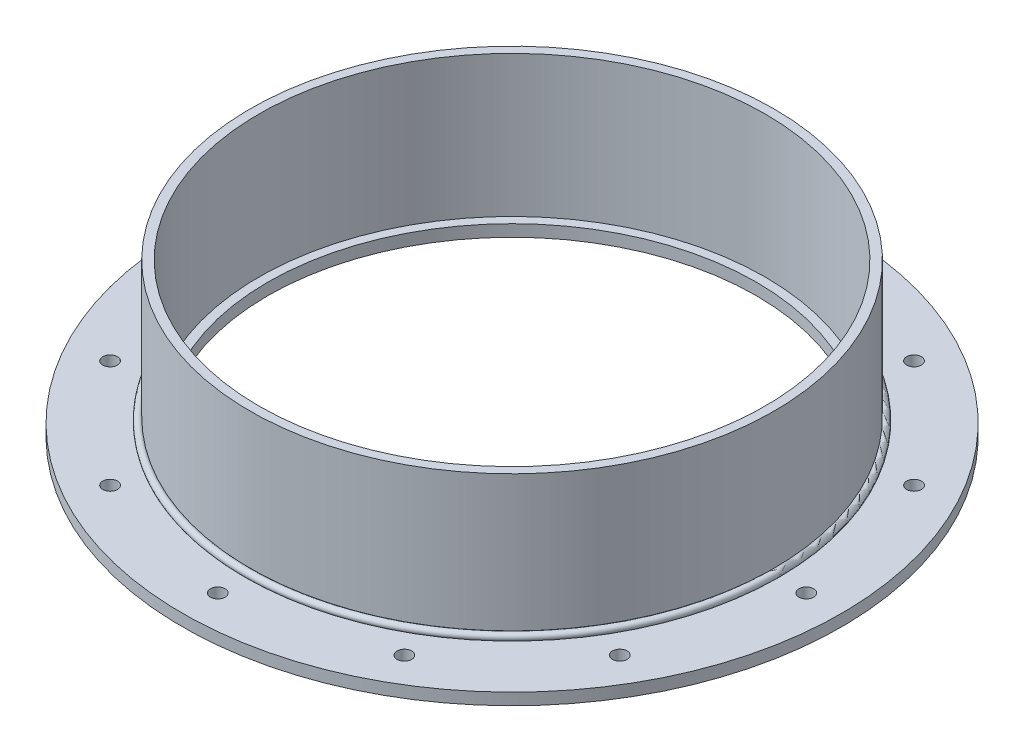
ISO-10303-21;
HEADER;
FILE_DESCRIPTION(('STEP AP214'),'2;1');
FILE_NAME('part.step','',(''),(''),'','','');
FILE_SCHEMA(('AUTOMOTIVE_DESIGN { 1 0 10303 214 1 1 1 1 }'));
ENDSEC;
DATA;
#1=APPLICATION_CONTEXT('core data for automotive mechanical design processes');
#2=APPLICATION_PROTOCOL_DEFINITION('international standard','automotive_design',2000,#1);
#3=PRODUCT_CONTEXT('',#1,'mechanical');
#4=PRODUCT('Part','Part','',(#3));
#5=PRODUCT_RELATED_PRODUCT_CATEGORY('part','',(#4));
#6=PRODUCT_DEFINITION_FORMATION('','',#4);
#7=PRODUCT_DEFINITION_CONTEXT('part definition',#1,'design');
#8=PRODUCT_DEFINITION('design','',#6,#7);
#9=PRODUCT_DEFINITION_SHAPE('','',#8);
#10=(LENGTH_UNIT() NAMED_UNIT(*) SI_UNIT(.MILLI.,.METRE.));
#11=(NAMED_UNIT(*) PLANE_ANGLE_UNIT() SI_UNIT($,.RADIAN.));
#12=(NAMED_UNIT(*) SI_UNIT($,.STERADIAN.) SOLID_ANGLE_UNIT());
#13=UNCERTAINTY_MEASURE_WITH_UNIT(LENGTH_MEASURE(1.E-05),#10,'distance_accuracy_value','');
#14=(GEOMETRIC_REPRESENTATION_CONTEXT(3) GLOBAL_UNCERTAINTY_ASSIGNED_CONTEXT((#13)) GLOBAL_UNIT_ASSIGNED_CONTEXT((#10,
#11,#12)) REPRESENTATION_CONTEXT('',''));
#15=CARTESIAN_POINT('',(0.,0.,0.));
#16=DIRECTION('',(0.,0.,1.));
#17=DIRECTION('',(1.,0.,0.));
#18=AXIS2_PLACEMENT_3D('',#15,#16,#17);
#19=CARTESIAN_POINT('',(0.,7.57337288963891,0.));
#20=DIRECTION('',(0.,-1.,0.));
#21=DIRECTION('',(0.,0.,-1.));
#22=AXIS2_PLACEMENT_3D('',#19,#20,#21);
#23=TOROIDAL_SURFACE('',#22,142.510872889639,1.98437500000001);
#24=CARTESIAN_POINT('',(0.,6.34999999999998,0.));
#25=DIRECTION('',(0.,-1.,0.));
#26=DIRECTION('',(0.,0.,-1.));
#27=AXIS2_PLACEMENT_3D('',#24,#25,#26);
#28=CIRCLE('',#27,144.073275818951);
#29=CARTESIAN_POINT('',(0.,6.34999999999998,-144.073275818951));
#30=VERTEX_POINT('',#29);
#31=EDGE_CURVE('E11',#30,#30,#28,.T.);
#32=ORIENTED_EDGE('',*,*,#31,.F.);
#33=EDGE_LOOP('',(#32));
#34=FACE_BOUND('',#33,.T.);
#35=CARTESIAN_POINT('',(0.,9.13577581895053,0.));
#36=DIRECTION('',(0.,-1.,0.));
#37=DIRECTION('',(0.,0.,-1.));
#38=AXIS2_PLACEMENT_3D('',#35,#36,#37);
#39=CIRCLE('',#38,141.2875);
#40=CARTESIAN_POINT('',(0.,9.13577581895053,-141.2875));
#41=VERTEX_POINT('',#40);
#42=EDGE_CURVE('E61',#41,#41,#39,.T.);
#43=ORIENTED_EDGE('',*,*,#42,.T.);
#44=EDGE_LOOP('',(#43));
#45=FACE_BOUND('',#44,.T.);
#46=ADVANCED_FACE('F48',(#34,#45),#23,.T.);
#47=CARTESIAN_POINT('',(-141.2875,6.34999999999998,0.));
#48=DIRECTION('',(0.,1.,0.));
#49=DIRECTION('',(0.,0.,1.));
#50=AXIS2_PLACEMENT_3D('',#47,#48,#49);
#51=PLANE('',#50);
#52=CARTESIAN_POINT('',(0.,6.34999999999998,0.));
#53=DIRECTION('',(0.,-1.,0.));
#54=DIRECTION('',(0.,0.,-1.));
#55=AXIS2_PLACEMENT_3D('',#52,#53,#54);
#56=CIRCLE('',#55,141.2875);
#57=CARTESIAN_POINT('',(0.,6.34999999999998,-141.2875));
#58=VERTEX_POINT('',#57);
#59=EDGE_CURVE('E55',#58,#58,#56,.T.);
#60=ORIENTED_EDGE('',*,*,#59,.F.);
#61=EDGE_LOOP('',(#60));
#62=FACE_BOUND('',#61,.T.);
#63=ORIENTED_EDGE('',*,*,#31,.T.);
#64=EDGE_LOOP('',(#63));
#65=FACE_BOUND('',#64,.T.);
#66=ADVANCED_FACE('F74',(#62,#65),#51,.F.);
#67=CARTESIAN_POINT('',(0.,0.,0.));
#68=DIRECTION('',(0.,-1.,0.));
#69=DIRECTION('',(0.,0.,-1.));
#70=AXIS2_PLACEMENT_3D('',#67,#68,#69);
#71=CYLINDRICAL_SURFACE('',#70,141.2875);
#72=ORIENTED_EDGE('',*,*,#42,.F.);
#73=EDGE_LOOP('',(#72));
#74=FACE_BOUND('',#73,.T.);
#75=ORIENTED_EDGE('',*,*,#59,.T.);
#76=EDGE_LOOP('',(#75));
#77=FACE_BOUND('',#76,.T.);
#78=ADVANCED_FACE('F72',(#74,#77),#71,.F.);
#79=CLOSED_SHELL('',(#46,#66,#78));
#80=MANIFOLD_SOLID_BREP('B2',#79);
#81=CARTESIAN_POINT('',(0.,0.,0.));
#82=DIRECTION('',(0.,-1.,0.));
#83=DIRECTION('',(0.,0.,-1.));
#84=AXIS2_PLACEMENT_3D('',#81,#82,#83);
#85=CYLINDRICAL_SURFACE('',#84,141.2875);
#86=CARTESIAN_POINT('',(0.,6.34999999999998,0.));
#87=DIRECTION('',(0.,-1.,0.));
#88=DIRECTION('',(0.,0.,-1.));
#89=AXIS2_PLACEMENT_3D('',#86,#87,#88);
#90=CIRCLE('',#89,141.2875);
#91=CARTESIAN_POINT('',(0.,6.34999999999998,-141.2875));
#92=VERTEX_POINT('',#91);
#93=EDGE_CURVE('E133',#92,#92,#90,.T.);
#94=ORIENTED_EDGE('',*,*,#93,.F.);
#95=EDGE_LOOP('',(#94));
#96=FACE_BOUND('',#95,.T.);
#97=CARTESIAN_POINT('',(0.,82.55,0.));
#98=DIRECTION('',(0.,-1.,0.));
#99=DIRECTION('',(0.,0.,-1.));
#100=AXIS2_PLACEMENT_3D('',#97,#98,#99);
#101=CIRCLE('',#100,141.2875);
#102=CARTESIAN_POINT('',(0.,82.55,-141.2875));
#103=VERTEX_POINT('',#102);
#104=EDGE_CURVE('E47',#103,#103,#101,.T.);
#105=ORIENTED_EDGE('',*,*,#104,.T.);
#106=EDGE_LOOP('',(#105));
#107=FACE_BOUND('',#106,.T.);
#108=ADVANCED_FACE('F114',(#96,#107),#85,.T.);
#109=CARTESIAN_POINT('',(-141.2875,82.55,0.));
#110=DIRECTION('',(0.,-1.,0.));
#111=DIRECTION('',(0.,0.,-1.));
#112=AXIS2_PLACEMENT_3D('',#109,#110,#111);
#113=PLANE('',#112);
#114=ORIENTED_EDGE('',*,*,#104,.F.);
#115=EDGE_LOOP('',(#114));
#116=FACE_BOUND('',#115,.T.);
#117=CARTESIAN_POINT('',(0.,82.55,0.));
#118=DIRECTION('',(0.,-1.,0.));
#119=DIRECTION('',(0.,0.,-1.));
#120=AXIS2_PLACEMENT_3D('',#117,#118,#119);
#121=CIRCLE('',#120,136.525);
#122=CARTESIAN_POINT('',(0.,82.55,-136.525));
#123=VERTEX_POINT('',#122);
#124=EDGE_CURVE('E121',#123,#123,#121,.T.);
#125=ORIENTED_EDGE('',*,*,#124,.T.);
#126=EDGE_LOOP('',(#125));
#127=FACE_BOUND('',#126,.T.);
#128=ADVANCED_FACE('F144',(#116,#127),#113,.F.);
#129=CARTESIAN_POINT('',(0.,0.,0.));
#130=DIRECTION('',(0.,-1.,0.));
#131=DIRECTION('',(0.,0.,-1.));
#132=AXIS2_PLACEMENT_3D('',#129,#130,#131);
#133=CYLINDRICAL_SURFACE('',#132,136.525);
#134=ORIENTED_EDGE('',*,*,#124,.F.);
#135=EDGE_LOOP('',(#134));
#136=FACE_BOUND('',#135,.T.);
#137=CARTESIAN_POINT('',(0.,6.34999999999998,0.));
#138=DIRECTION('',(0.,-1.,0.));
#139=DIRECTION('',(0.,0.,-1.));
#140=AXIS2_PLACEMENT_3D('',#137,#138,#139);
#141=CIRCLE('',#140,136.525);
#142=CARTESIAN_POINT('',(0.,6.34999999999998,-136.525));
#143=VERTEX_POINT('',#142);
#144=EDGE_CURVE('E127',#143,#143,#141,.T.);
#145=ORIENTED_EDGE('',*,*,#144,.T.);
#146=EDGE_LOOP('',(#145));
#147=FACE_BOUND('',#146,.T.);
#148=ADVANCED_FACE('F148',(#136,#147),#133,.F.);
#149=CARTESIAN_POINT('',(-141.2875,6.34999999999998,0.));
#150=DIRECTION('',(0.,1.,0.));
#151=DIRECTION('',(0.,0.,1.));
#152=AXIS2_PLACEMENT_3D('',#149,#150,#151);
#153=PLANE('',#152);
#154=ORIENTED_EDGE('',*,*,#144,.F.);
#155=EDGE_LOOP('',(#154));
#156=FACE_BOUND('',#155,.T.);
#157=ORIENTED_EDGE('',*,*,#93,.T.);
#158=EDGE_LOOP('',(#157));
#159=FACE_BOUND('',#158,.T.);
#160=ADVANCED_FACE('F141',(#156,#159),#153,.F.);
#161=CLOSED_SHELL('',(#108,#128,#148,#160));
#162=MANIFOLD_SOLID_BREP('B6',#161);
#163=CARTESIAN_POINT('',(0.,0.,0.));
#164=DIRECTION('',(0.,-1.,0.));
#165=DIRECTION('',(0.,0.,-1.));
#166=AXIS2_PLACEMENT_3D('',#163,#164,#165);
#167=CYLINDRICAL_SURFACE('',#166,131.7625);
#168=CARTESIAN_POINT('',(0.,6.34999999999999,0.));
#169=DIRECTION('',(0.,-1.,0.));
#170=DIRECTION('',(0.,0.,-1.));
#171=AXIS2_PLACEMENT_3D('',#168,#169,#170);
#172=CIRCLE('',#171,131.7625);
#173=CARTESIAN_POINT('',(0.,6.34999999999999,-131.7625));
#174=VERTEX_POINT('',#173);
#175=EDGE_CURVE('E113',#174,#174,#172,.T.);
#176=ORIENTED_EDGE('',*,*,#175,.F.);
#177=EDGE_LOOP('',(#176));
#178=FACE_BOUND('',#177,.T.);
#179=CARTESIAN_POINT('',(0.,0.,0.));
#180=DIRECTION('',(0.,-1.,0.));
#181=DIRECTION('',(0.,0.,-1.));
#182=AXIS2_PLACEMENT_3D('',#179,#180,#181);
#183=CIRCLE('',#182,131.7625);
#184=CARTESIAN_POINT('',(0.,0.,-131.7625));
#185=VERTEX_POINT('',#184);
#186=EDGE_CURVE('E211',#185,#185,#183,.T.);
#187=ORIENTED_EDGE('',*,*,#186,.T.);
#188=EDGE_LOOP('',(#187));
#189=FACE_BOUND('',#188,.T.);
#190=ADVANCED_FACE('F192',(#178,#189),#167,.F.);
#191=CARTESIAN_POINT('',(-131.7625,6.34999999999999,0.));
#192=DIRECTION('',(0.,-1.,0.));
#193=DIRECTION('',(0.,0.,-1.));
#194=AXIS2_PLACEMENT_3D('',#191,#192,#193);
#195=PLANE('',#194);
#196=CARTESIAN_POINT('',(-79.3749999999982,6.34999999999999,-137.481532850781));
#197=DIRECTION('',(0.,1.,0.));
#198=DIRECTION('',(0.499999999999989,0.,0.866025403784445));
#199=AXIS2_PLACEMENT_3D('',#196,#197,#198);
#200=CIRCLE('',#199,3.96875);
#201=CARTESIAN_POINT('',(-77.3906249999983,6.34999999999999,-134.044494529511));
#202=VERTEX_POINT('',#201);
#203=EDGE_CURVE('E306',#202,#202,#200,.T.);
#204=ORIENTED_EDGE('',*,*,#203,.F.);
#205=EDGE_LOOP('',(#204));
#206=FACE_BOUND('',#205,.T.);
#207=CARTESIAN_POINT('',(-137.481532850779,6.34999999999999,-79.3750000000016));
#208=DIRECTION('',(0.,1.,0.));
#209=DIRECTION('',(0.866025403784433,0.,0.50000000000001));
#210=AXIS2_PLACEMENT_3D('',#207,#208,#209);
#211=CIRCLE('',#210,3.96875);
#212=CARTESIAN_POINT('',(-134.044494529509,6.34999999999999,-77.3906250000016));
#213=VERTEX_POINT('',#212);
#214=EDGE_CURVE('E298',#213,#213,#211,.T.);
#215=ORIENTED_EDGE('',*,*,#214,.F.);
#216=EDGE_LOOP('',(#215));
#217=FACE_BOUND('',#216,.T.);
#218=CARTESIAN_POINT('',(-158.75,6.34999999999999,-1.66281798762404E-12));
#219=DIRECTION('',(0.,1.,0.));
#220=DIRECTION('',(1.,0.,0.));
#221=AXIS2_PLACEMENT_3D('',#218,#219,#220);
#222=CIRCLE('',#221,3.96875);
#223=CARTESIAN_POINT('',(-154.78125,6.34999999999999,-1.62124753793344E-12));
#224=VERTEX_POINT('',#223);
#225=EDGE_CURVE('E290',#224,#224,#222,.T.);
#226=ORIENTED_EDGE('',*,*,#225,.F.);
#227=EDGE_LOOP('',(#226));
#228=FACE_BOUND('',#227,.T.);
#229=CARTESIAN_POINT('',(-137.48153285078,6.34999999999999,79.3749999999987));
#230=DIRECTION('',(0.,1.,0.));
#231=DIRECTION('',(0.866025403784443,0.,-0.499999999999992));
#232=AXIS2_PLACEMENT_3D('',#229,#230,#231);
#233=CIRCLE('',#232,3.96875);
#234=CARTESIAN_POINT('',(-134.044494529511,6.34999999999999,77.3906249999987));
#235=VERTEX_POINT('',#234);
#236=EDGE_CURVE('E282',#235,#235,#233,.T.);
#237=ORIENTED_EDGE('',*,*,#236,.F.);
#238=EDGE_LOOP('',(#237));
#239=FACE_BOUND('',#238,.T.);
#240=CARTESIAN_POINT('',(-79.3750000000011,6.34999999999999,137.481532850779));
#241=DIRECTION('',(0.,1.,0.));
#242=DIRECTION('',(0.500000000000007,0.,-0.866025403784435));
#243=AXIS2_PLACEMENT_3D('',#240,#241,#242);
#244=CIRCLE('',#243,3.96875);
#245=CARTESIAN_POINT('',(-77.3906250000011,6.34999999999999,134.04449452951));
#246=VERTEX_POINT('',#245);
#247=EDGE_CURVE('E274',#246,#246,#244,.T.);
#248=ORIENTED_EDGE('',*,*,#247,.F.);
#249=EDGE_LOOP('',(#248));
#250=FACE_BOUND('',#249,.T.);
#251=CARTESIAN_POINT('',(0.,6.34999999999999,158.75));
#252=DIRECTION('',(0.,1.,0.));
#253=DIRECTION('',(0.,0.,-1.));
#254=AXIS2_PLACEMENT_3D('',#251,#252,#253);
#255=CIRCLE('',#254,3.96875);
#256=CARTESIAN_POINT('',(0.,6.34999999999999,154.78125));
#257=VERTEX_POINT('',#256);
#258=EDGE_CURVE('E266',#257,#257,#255,.T.);
#259=ORIENTED_EDGE('',*,*,#258,.F.);
#260=EDGE_LOOP('',(#259));
#261=FACE_BOUND('',#260,.T.);
#262=CARTESIAN_POINT('',(79.3749999999992,6.34999999999999,137.48153285078));
#263=DIRECTION('',(0.,1.,0.));
#264=DIRECTION('',(-0.499999999999995,0.,-0.866025403784442));
#265=AXIS2_PLACEMENT_3D('',#262,#263,#264);
#266=CIRCLE('',#265,3.96875);
#267=CARTESIAN_POINT('',(77.3906249999992,6.34999999999999,134.044494529511));
#268=VERTEX_POINT('',#267);
#269=EDGE_CURVE('E258',#268,#268,#266,.T.);
#270=ORIENTED_EDGE('',*,*,#269,.F.);
#271=EDGE_LOOP('',(#270));
#272=FACE_BOUND('',#271,.T.);
#273=CARTESIAN_POINT('',(137.481532850779,6.34999999999999,79.3750000000007));
#274=DIRECTION('',(0.,1.,0.));
#275=DIRECTION('',(-0.866025403784436,0.,-0.500000000000004));
#276=AXIS2_PLACEMENT_3D('',#273,#274,#275);
#277=CIRCLE('',#276,3.96875);
#278=CARTESIAN_POINT('',(134.04449452951,6.34999999999999,77.3906250000006));
#279=VERTEX_POINT('',#278);
#280=EDGE_CURVE('E250',#279,#279,#277,.T.);
#281=ORIENTED_EDGE('',*,*,#280,.F.);
#282=EDGE_LOOP('',(#281));
#283=FACE_BOUND('',#282,.T.);
#284=CARTESIAN_POINT('',(158.75,6.34999999999999,5.54272662541347E-13));
#285=DIRECTION('',(0.,1.,0.));
#286=DIRECTION('',(-1.,0.,0.));
#287=AXIS2_PLACEMENT_3D('',#284,#285,#286);
#288=CIRCLE('',#287,3.96875);
#289=CARTESIAN_POINT('',(154.78125,6.34999999999999,5.40415845977814E-13));
#290=VERTEX_POINT('',#289);
#291=EDGE_CURVE('E242',#290,#290,#288,.T.);
#292=ORIENTED_EDGE('',*,*,#291,.F.);
#293=EDGE_LOOP('',(#292));
#294=FACE_BOUND('',#293,.T.);
#295=CARTESIAN_POINT('',(137.48153285078,6.34999999999999,-79.3749999999997));
#296=DIRECTION('',(0.,1.,0.));
#297=DIRECTION('',(-0.86602540378444,0.,0.499999999999998));
#298=AXIS2_PLACEMENT_3D('',#295,#296,#297);
#299=CIRCLE('',#298,3.96875);
#300=CARTESIAN_POINT('',(134.04449452951,6.34999999999999,-77.3906249999997));
#301=VERTEX_POINT('',#300);
#302=EDGE_CURVE('E234',#301,#301,#299,.T.);
#303=ORIENTED_EDGE('',*,*,#302,.F.);
#304=EDGE_LOOP('',(#303));
#305=FACE_BOUND('',#304,.T.);
#306=CARTESIAN_POINT('',(79.3750000000002,6.34999999999999,-137.48153285078));
#307=DIRECTION('',(0.,1.,0.));
#308=DIRECTION('',(-0.500000000000001,0.,0.866025403784438));
#309=AXIS2_PLACEMENT_3D('',#306,#307,#308);
#310=CIRCLE('',#309,3.96875);
#311=CARTESIAN_POINT('',(77.3906250000002,6.34999999999999,-134.04449452951));
#312=VERTEX_POINT('',#311);
#313=EDGE_CURVE('E226',#312,#312,#310,.T.);
#314=ORIENTED_EDGE('',*,*,#313,.F.);
#315=EDGE_LOOP('',(#314));
#316=FACE_BOUND('',#315,.T.);
#317=CARTESIAN_POINT('',(0.,6.34999999999999,-158.75));
#318=DIRECTION('',(0.,1.,0.));
#319=DIRECTION('',(0.,0.,1.));
#320=AXIS2_PLACEMENT_3D('',#317,#318,#319);
#321=CIRCLE('',#320,3.96875);
#322=CARTESIAN_POINT('',(0.,6.34999999999999,-154.78125));
#323=VERTEX_POINT('',#322);
#324=EDGE_CURVE('E218',#323,#323,#321,.T.);
#325=ORIENTED_EDGE('',*,*,#324,.F.);
#326=EDGE_LOOP('',(#325));
#327=FACE_BOUND('',#326,.T.);
#328=CARTESIAN_POINT('',(0.,6.34999999999998,0.));
#329=DIRECTION('',(0.,-1.,0.));
#330=DIRECTION('',(0.,0.,-1.));
#331=AXIS2_PLACEMENT_3D('',#328,#329,#330);
#332=CIRCLE('',#331,177.8);
#333=CARTESIAN_POINT('',(0.,6.34999999999998,-177.8));
#334=VERTEX_POINT('',#333);
#335=EDGE_CURVE('E199',#334,#334,#332,.T.);
#336=ORIENTED_EDGE('',*,*,#335,.F.);
#337=EDGE_LOOP('',(#336));
#338=FACE_BOUND('',#337,.T.);
#339=ORIENTED_EDGE('',*,*,#175,.T.);
#340=EDGE_LOOP('',(#339));
#341=FACE_BOUND('',#340,.T.);
#342=ADVANCED_FACE('F325',(#206,#217,#228,#239,#250,#261,#272,#283,#294,#305,#316,#327,#338,
#341),#195,.F.);
#343=CARTESIAN_POINT('',(0.,0.,0.));
#344=DIRECTION('',(0.,-1.,0.));
#345=DIRECTION('',(0.,0.,-1.));
#346=AXIS2_PLACEMENT_3D('',#343,#344,#345);
#347=CYLINDRICAL_SURFACE('',#346,177.8);
#348=CARTESIAN_POINT('',(0.,0.,0.));
#349=DIRECTION('',(0.,-1.,0.));
#350=DIRECTION('',(0.,0.,-1.));
#351=AXIS2_PLACEMENT_3D('',#348,#349,#350);
#352=CIRCLE('',#351,177.8);
#353=CARTESIAN_POINT('',(0.,0.,-177.8));
#354=VERTEX_POINT('',#353);
#355=EDGE_CURVE('E205',#354,#354,#352,.T.);
#356=ORIENTED_EDGE('',*,*,#355,.F.);
#357=EDGE_LOOP('',(#356));
#358=FACE_BOUND('',#357,.T.);
#359=ORIENTED_EDGE('',*,*,#335,.T.);
#360=EDGE_LOOP('',(#359));
#361=FACE_BOUND('',#360,.T.);
#362=ADVANCED_FACE('F328',(#358,#361),#347,.T.);
#363=CARTESIAN_POINT('',(-131.7625,0.,0.));
#364=DIRECTION('',(0.,1.,0.));
#365=DIRECTION('',(0.,0.,1.));
#366=AXIS2_PLACEMENT_3D('',#363,#364,#365);
#367=PLANE('',#366);
#368=CARTESIAN_POINT('',(-79.3749999999982,0.,-137.481532850781));
#369=DIRECTION('',(0.,1.,0.));
#370=DIRECTION('',(0.499999999999989,0.,0.866025403784445));
#371=AXIS2_PLACEMENT_3D('',#368,#369,#370);
#372=CIRCLE('',#371,3.96875);
#373=CARTESIAN_POINT('',(-77.3906249999983,0.,-134.044494529511));
#374=VERTEX_POINT('',#373);
#375=EDGE_CURVE('E302',#374,#374,#372,.T.);
#376=ORIENTED_EDGE('',*,*,#375,.T.);
#377=EDGE_LOOP('',(#376));
#378=FACE_BOUND('',#377,.T.);
#379=CARTESIAN_POINT('',(-137.481532850779,0.,-79.3750000000016));
#380=DIRECTION('',(0.,1.,0.));
#381=DIRECTION('',(0.866025403784433,0.,0.50000000000001));
#382=AXIS2_PLACEMENT_3D('',#379,#380,#381);
#383=CIRCLE('',#382,3.96875);
#384=CARTESIAN_POINT('',(-134.044494529509,0.,-77.3906250000016));
#385=VERTEX_POINT('',#384);
#386=EDGE_CURVE('E294',#385,#385,#383,.T.);
#387=ORIENTED_EDGE('',*,*,#386,.T.);
#388=EDGE_LOOP('',(#387));
#389=FACE_BOUND('',#388,.T.);
#390=CARTESIAN_POINT('',(-158.75,0.,-1.66281798762404E-12));
#391=DIRECTION('',(0.,1.,0.));
#392=DIRECTION('',(1.,0.,0.));
#393=AXIS2_PLACEMENT_3D('',#390,#391,#392);
#394=CIRCLE('',#393,3.96875);
#395=CARTESIAN_POINT('',(-154.78125,0.,-1.62124753793344E-12));
#396=VERTEX_POINT('',#395);
#397=EDGE_CURVE('E286',#396,#396,#394,.T.);
#398=ORIENTED_EDGE('',*,*,#397,.T.);
#399=EDGE_LOOP('',(#398));
#400=FACE_BOUND('',#399,.T.);
#401=CARTESIAN_POINT('',(-137.48153285078,0.,79.3749999999987));
#402=DIRECTION('',(0.,1.,0.));
#403=DIRECTION('',(0.866025403784443,0.,-0.499999999999992));
#404=AXIS2_PLACEMENT_3D('',#401,#402,#403);
#405=CIRCLE('',#404,3.96875);
#406=CARTESIAN_POINT('',(-134.044494529511,0.,77.3906249999987));
#407=VERTEX_POINT('',#406);
#408=EDGE_CURVE('E278',#407,#407,#405,.T.);
#409=ORIENTED_EDGE('',*,*,#408,.T.);
#410=EDGE_LOOP('',(#409));
#411=FACE_BOUND('',#410,.T.);
#412=CARTESIAN_POINT('',(-79.3750000000011,0.,137.481532850779));
#413=DIRECTION('',(0.,1.,0.));
#414=DIRECTION('',(0.500000000000007,0.,-0.866025403784435));
#415=AXIS2_PLACEMENT_3D('',#412,#413,#414);
#416=CIRCLE('',#415,3.96875);
#417=CARTESIAN_POINT('',(-77.3906250000011,0.,134.04449452951));
#418=VERTEX_POINT('',#417);
#419=EDGE_CURVE('E270',#418,#418,#416,.T.);
#420=ORIENTED_EDGE('',*,*,#419,.T.);
#421=EDGE_LOOP('',(#420));
#422=FACE_BOUND('',#421,.T.);
#423=CARTESIAN_POINT('',(0.,0.,158.75));
#424=DIRECTION('',(0.,1.,0.));
#425=DIRECTION('',(0.,0.,-1.));
#426=AXIS2_PLACEMENT_3D('',#423,#424,#425);
#427=CIRCLE('',#426,3.96875);
#428=CARTESIAN_POINT('',(0.,0.,154.78125));
#429=VERTEX_POINT('',#428);
#430=EDGE_CURVE('E262',#429,#429,#427,.T.);
#431=ORIENTED_EDGE('',*,*,#430,.T.);
#432=EDGE_LOOP('',(#431));
#433=FACE_BOUND('',#432,.T.);
#434=CARTESIAN_POINT('',(79.3749999999992,0.,137.48153285078));
#435=DIRECTION('',(0.,1.,0.));
#436=DIRECTION('',(-0.499999999999995,0.,-0.866025403784442));
#437=AXIS2_PLACEMENT_3D('',#434,#435,#436);
#438=CIRCLE('',#437,3.96875);
#439=CARTESIAN_POINT('',(77.3906249999992,0.,134.044494529511));
#440=VERTEX_POINT('',#439);
#441=EDGE_CURVE('E254',#440,#440,#438,.T.);
#442=ORIENTED_EDGE('',*,*,#441,.T.);
#443=EDGE_LOOP('',(#442));
#444=FACE_BOUND('',#443,.T.);
#445=CARTESIAN_POINT('',(137.481532850779,0.,79.3750000000007));
#446=DIRECTION('',(0.,1.,0.));
#447=DIRECTION('',(-0.866025403784436,0.,-0.500000000000004));
#448=AXIS2_PLACEMENT_3D('',#445,#446,#447);
#449=CIRCLE('',#448,3.96875);
#450=CARTESIAN_POINT('',(134.04449452951,0.,77.3906250000006));
#451=VERTEX_POINT('',#450);
#452=EDGE_CURVE('E246',#451,#451,#449,.T.);
#453=ORIENTED_EDGE('',*,*,#452,.T.);
#454=EDGE_LOOP('',(#453));
#455=FACE_BOUND('',#454,.T.);
#456=CARTESIAN_POINT('',(158.75,0.,5.54272662541347E-13));
#457=DIRECTION('',(0.,1.,0.));
#458=DIRECTION('',(-1.,0.,0.));
#459=AXIS2_PLACEMENT_3D('',#456,#457,#458);
#460=CIRCLE('',#459,3.96875);
#461=CARTESIAN_POINT('',(154.78125,0.,5.40415845977814E-13));
#462=VERTEX_POINT('',#461);
#463=EDGE_CURVE('E238',#462,#462,#460,.T.);
#464=ORIENTED_EDGE('',*,*,#463,.T.);
#465=EDGE_LOOP('',(#464));
#466=FACE_BOUND('',#465,.T.);
#467=CARTESIAN_POINT('',(137.48153285078,0.,-79.3749999999997));
#468=DIRECTION('',(0.,1.,0.));
#469=DIRECTION('',(-0.86602540378444,0.,0.499999999999998));
#470=AXIS2_PLACEMENT_3D('',#467,#468,#469);
#471=CIRCLE('',#470,3.96875);
#472=CARTESIAN_POINT('',(134.04449452951,0.,-77.3906249999997));
#473=VERTEX_POINT('',#472);
#474=EDGE_CURVE('E230',#473,#473,#471,.T.);
#475=ORIENTED_EDGE('',*,*,#474,.T.);
#476=EDGE_LOOP('',(#475));
#477=FACE_BOUND('',#476,.T.);
#478=CARTESIAN_POINT('',(79.3750000000002,0.,-137.48153285078));
#479=DIRECTION('',(0.,1.,0.));
#480=DIRECTION('',(-0.500000000000001,0.,0.866025403784438));
#481=AXIS2_PLACEMENT_3D('',#478,#479,#480);
#482=CIRCLE('',#481,3.96875);
#483=CARTESIAN_POINT('',(77.3906250000002,0.,-134.04449452951));
#484=VERTEX_POINT('',#483);
#485=EDGE_CURVE('E222',#484,#484,#482,.T.);
#486=ORIENTED_EDGE('',*,*,#485,.T.);
#487=EDGE_LOOP('',(#486));
#488=FACE_BOUND('',#487,.T.);
#489=CARTESIAN_POINT('',(0.,0.,-158.75));
#490=DIRECTION('',(0.,1.,0.));
#491=DIRECTION('',(0.,0.,1.));
#492=AXIS2_PLACEMENT_3D('',#489,#490,#491);
#493=CIRCLE('',#492,3.96875);
#494=CARTESIAN_POINT('',(0.,0.,-154.78125));
#495=VERTEX_POINT('',#494);
#496=EDGE_CURVE('E217',#495,#495,#493,.T.);
#497=ORIENTED_EDGE('',*,*,#496,.T.);
#498=EDGE_LOOP('',(#497));
#499=FACE_BOUND('',#498,.T.);
#500=ORIENTED_EDGE('',*,*,#186,.F.);
#501=EDGE_LOOP('',(#500));
#502=FACE_BOUND('',#501,.T.);
#503=ORIENTED_EDGE('',*,*,#355,.T.);
#504=EDGE_LOOP('',(#503));
#505=FACE_BOUND('',#504,.T.);
#506=ADVANCED_FACE('F315',(#378,#389,#400,#411,#422,#433,#444,#455,#466,#477,#488,#499,#502,
#505),#367,.F.);
#507=CARTESIAN_POINT('',(0.,0.,-158.75));
#508=DIRECTION('',(0.,1.,0.));
#509=DIRECTION('',(0.,0.,1.));
#510=AXIS2_PLACEMENT_3D('',#507,#508,#509);
#511=CYLINDRICAL_SURFACE('',#510,3.96875);
#512=ORIENTED_EDGE('',*,*,#496,.F.);
#513=EDGE_LOOP('',(#512));
#514=FACE_BOUND('',#513,.T.);
#515=ORIENTED_EDGE('',*,*,#324,.T.);
#516=EDGE_LOOP('',(#515));
#517=FACE_BOUND('',#516,.T.);
#518=ADVANCED_FACE('F352',(#514,#517),#511,.F.);
#519=CARTESIAN_POINT('',(79.3750000000002,0.,-137.48153285078));
#520=DIRECTION('',(0.,1.,0.));
#521=DIRECTION('',(0.,0.,1.));
#522=AXIS2_PLACEMENT_3D('',#519,#520,#521);
#523=CYLINDRICAL_SURFACE('',#522,3.96875);
#524=ORIENTED_EDGE('',*,*,#485,.F.);
#525=EDGE_LOOP('',(#524));
#526=FACE_BOUND('',#525,.T.);
#527=ORIENTED_EDGE('',*,*,#313,.T.);
#528=EDGE_LOOP('',(#527));
#529=FACE_BOUND('',#528,.T.);
#530=ADVANCED_FACE('F354',(#526,#529),#523,.F.);
#531=CARTESIAN_POINT('',(137.48153285078,0.,-79.3749999999997));
#532=DIRECTION('',(0.,1.,0.));
#533=DIRECTION('',(0.,0.,1.));
#534=AXIS2_PLACEMENT_3D('',#531,#532,#533);
#535=CYLINDRICAL_SURFACE('',#534,3.96875);
#536=ORIENTED_EDGE('',*,*,#474,.F.);
#537=EDGE_LOOP('',(#536));
#538=FACE_BOUND('',#537,.T.);
#539=ORIENTED_EDGE('',*,*,#302,.T.);
#540=EDGE_LOOP('',(#539));
#541=FACE_BOUND('',#540,.T.);
#542=ADVANCED_FACE('F361',(#538,#541),#535,.F.);
#543=CARTESIAN_POINT('',(158.75,0.,5.54272662541347E-13));
#544=DIRECTION('',(0.,1.,0.));
#545=DIRECTION('',(0.,0.,1.));
#546=AXIS2_PLACEMENT_3D('',#543,#544,#545);
#547=CYLINDRICAL_SURFACE('',#546,3.96875);
#548=ORIENTED_EDGE('',*,*,#463,.F.);
#549=EDGE_LOOP('',(#548));
#550=FACE_BOUND('',#549,.T.);
#551=ORIENTED_EDGE('',*,*,#291,.T.);
#552=EDGE_LOOP('',(#551));
#553=FACE_BOUND('',#552,.T.);
#554=ADVANCED_FACE('F406',(#550,#553),#547,.F.);
#555=CARTESIAN_POINT('',(137.481532850779,0.,79.3750000000007));
#556=DIRECTION('',(0.,1.,0.));
#557=DIRECTION('',(0.,0.,1.));
#558=AXIS2_PLACEMENT_3D('',#555,#556,#557);
#559=CYLINDRICAL_SURFACE('',#558,3.96875);
#560=ORIENTED_EDGE('',*,*,#452,.F.);
#561=EDGE_LOOP('',(#560));
#562=FACE_BOUND('',#561,.T.);
#563=ORIENTED_EDGE('',*,*,#280,.T.);
#564=EDGE_LOOP('',(#563));
#565=FACE_BOUND('',#564,.T.);
#566=ADVANCED_FACE('F416',(#562,#565),#559,.F.);
#567=CARTESIAN_POINT('',(79.3749999999992,0.,137.48153285078));
#568=DIRECTION('',(0.,1.,0.));
#569=DIRECTION('',(0.,0.,1.));
#570=AXIS2_PLACEMENT_3D('',#567,#568,#569);
#571=CYLINDRICAL_SURFACE('',#570,3.96875);
#572=ORIENTED_EDGE('',*,*,#441,.F.);
#573=EDGE_LOOP('',(#572));
#574=FACE_BOUND('',#573,.T.);
#575=ORIENTED_EDGE('',*,*,#269,.T.);
#576=EDGE_LOOP('',(#575));
#577=FACE_BOUND('',#576,.T.);
#578=ADVANCED_FACE('F426',(#574,#577),#571,.F.);
#579=CARTESIAN_POINT('',(0.,0.,158.75));
#580=DIRECTION('',(0.,1.,0.));
#581=DIRECTION('',(0.,0.,1.));
#582=AXIS2_PLACEMENT_3D('',#579,#580,#581);
#583=CYLINDRICAL_SURFACE('',#582,3.96875);
#584=ORIENTED_EDGE('',*,*,#430,.F.);
#585=EDGE_LOOP('',(#584));
#586=FACE_BOUND('',#585,.T.);
#587=ORIENTED_EDGE('',*,*,#258,.T.);
#588=EDGE_LOOP('',(#587));
#589=FACE_BOUND('',#588,.T.);
#590=ADVANCED_FACE('F436',(#586,#589),#583,.F.);
#591=CARTESIAN_POINT('',(-79.3750000000011,0.,137.481532850779));
#592=DIRECTION('',(0.,1.,0.));
#593=DIRECTION('',(0.,0.,1.));
#594=AXIS2_PLACEMENT_3D('',#591,#592,#593);
#595=CYLINDRICAL_SURFACE('',#594,3.96875);
#596=ORIENTED_EDGE('',*,*,#419,.F.);
#597=EDGE_LOOP('',(#596));
#598=FACE_BOUND('',#597,.T.);
#599=ORIENTED_EDGE('',*,*,#247,.T.);
#600=EDGE_LOOP('',(#599));
#601=FACE_BOUND('',#600,.T.);
#602=ADVANCED_FACE('F446',(#598,#601),#595,.F.);
#603=CARTESIAN_POINT('',(-137.48153285078,0.,79.3749999999987));
#604=DIRECTION('',(0.,1.,0.));
#605=DIRECTION('',(0.,0.,1.));
#606=AXIS2_PLACEMENT_3D('',#603,#604,#605);
#607=CYLINDRICAL_SURFACE('',#606,3.96875);
#608=ORIENTED_EDGE('',*,*,#408,.F.);
#609=EDGE_LOOP('',(#608));
#610=FACE_BOUND('',#609,.T.);
#611=ORIENTED_EDGE('',*,*,#236,.T.);
#612=EDGE_LOOP('',(#611));
#613=FACE_BOUND('',#612,.T.);
#614=ADVANCED_FACE('F456',(#610,#613),#607,.F.);
#615=CARTESIAN_POINT('',(-158.75,0.,-1.66281798762404E-12));
#616=DIRECTION('',(0.,1.,0.));
#617=DIRECTION('',(0.,0.,1.));
#618=AXIS2_PLACEMENT_3D('',#615,#616,#617);
#619=CYLINDRICAL_SURFACE('',#618,3.96875);
#620=ORIENTED_EDGE('',*,*,#397,.F.);
#621=EDGE_LOOP('',(#620));
#622=FACE_BOUND('',#621,.T.);
#623=ORIENTED_EDGE('',*,*,#225,.T.);
#624=EDGE_LOOP('',(#623));
#625=FACE_BOUND('',#624,.T.);
#626=ADVANCED_FACE('F466',(#622,#625),#619,.F.);
#627=CARTESIAN_POINT('',(-137.481532850779,0.,-79.3750000000016));
#628=DIRECTION('',(0.,1.,0.));
#629=DIRECTION('',(0.,0.,1.));
#630=AXIS2_PLACEMENT_3D('',#627,#628,#629);
#631=CYLINDRICAL_SURFACE('',#630,3.96875);
#632=ORIENTED_EDGE('',*,*,#386,.F.);
#633=EDGE_LOOP('',(#632));
#634=FACE_BOUND('',#633,.T.);
#635=ORIENTED_EDGE('',*,*,#214,.T.);
#636=EDGE_LOOP('',(#635));
#637=FACE_BOUND('',#636,.T.);
#638=ADVANCED_FACE('F321',(#634,#637),#631,.F.);
#639=CARTESIAN_POINT('',(-79.3749999999982,0.,-137.481532850781));
#640=DIRECTION('',(0.,1.,0.));
#641=DIRECTION('',(0.,0.,1.));
#642=AXIS2_PLACEMENT_3D('',#639,#640,#641);
#643=CYLINDRICAL_SURFACE('',#642,3.96875);
#644=ORIENTED_EDGE('',*,*,#375,.F.);
#645=EDGE_LOOP('',(#644));
#646=FACE_BOUND('',#645,.T.);
#647=ORIENTED_EDGE('',*,*,#203,.T.);
#648=EDGE_LOOP('',(#647));
#649=FACE_BOUND('',#648,.T.);
#650=ADVANCED_FACE('F318',(#646,#649),#643,.F.);
#651=CLOSED_SHELL('',(#190,#342,#362,#506,#518,#530,#542,#554,#566,#578,#590,#602,#614,#626,
#638,#650));
#652=MANIFOLD_SOLID_BREP('B42',#651);
#653=ADVANCED_BREP_SHAPE_REPRESENTATION('',(#18,#80,#162,#652),#14);
#654=SHAPE_DEFINITION_REPRESENTATION(#9,#653);
ENDSEC;
END-ISO-10303-21;
